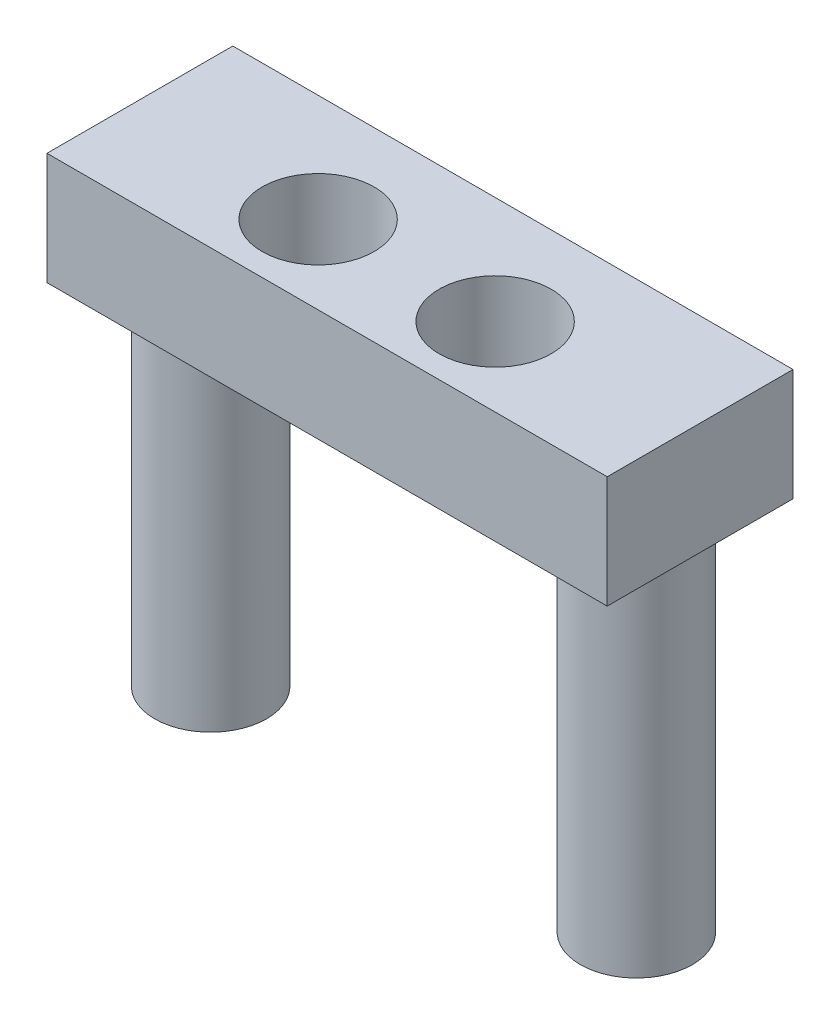
ISO-10303-21;
HEADER;
FILE_DESCRIPTION(('STEP AP214'),'2;1');
FILE_NAME('part.step','',(''),(''),'','','');
FILE_SCHEMA(('AUTOMOTIVE_DESIGN { 1 0 10303 214 1 1 1 1 }'));
ENDSEC;
DATA;
#1=APPLICATION_CONTEXT('core data for automotive mechanical design processes');
#2=APPLICATION_PROTOCOL_DEFINITION('international standard','automotive_design',2000,#1);
#3=PRODUCT_CONTEXT('',#1,'mechanical');
#4=PRODUCT('Part','Part','',(#3));
#5=PRODUCT_RELATED_PRODUCT_CATEGORY('part','',(#4));
#6=PRODUCT_DEFINITION_FORMATION('','',#4);
#7=PRODUCT_DEFINITION_CONTEXT('part definition',#1,'design');
#8=PRODUCT_DEFINITION('design','',#6,#7);
#9=PRODUCT_DEFINITION_SHAPE('','',#8);
#10=(LENGTH_UNIT() NAMED_UNIT(*) SI_UNIT(.MILLI.,.METRE.));
#11=(NAMED_UNIT(*) PLANE_ANGLE_UNIT() SI_UNIT($,.RADIAN.));
#12=(NAMED_UNIT(*) SI_UNIT($,.STERADIAN.) SOLID_ANGLE_UNIT());
#13=UNCERTAINTY_MEASURE_WITH_UNIT(LENGTH_MEASURE(1.E-05),#10,'distance_accuracy_value','');
#14=(GEOMETRIC_REPRESENTATION_CONTEXT(3) GLOBAL_UNCERTAINTY_ASSIGNED_CONTEXT((#13)) GLOBAL_UNIT_ASSIGNED_CONTEXT((#10,
#11,#12)) REPRESENTATION_CONTEXT('',''));
#15=CARTESIAN_POINT('',(0.,0.,0.));
#16=DIRECTION('',(0.,0.,1.));
#17=DIRECTION('',(1.,0.,0.));
#18=AXIS2_PLACEMENT_3D('',#15,#16,#17);
#19=CARTESIAN_POINT('',(0.,0.,0.));
#20=DIRECTION('',(0.,1.,0.));
#21=DIRECTION('',(0.,0.,1.));
#22=AXIS2_PLACEMENT_3D('',#19,#20,#21);
#23=PLANE('',#22);
#24=CARTESIAN_POINT('',(28.0616648173004,0.,-21.0042159147239));
#25=DIRECTION('',(0.,1.,0.));
#26=DIRECTION('',(0.,0.,1.));
#27=AXIS2_PLACEMENT_3D('',#24,#25,#26);
#28=CIRCLE('',#27,5.);
#29=CARTESIAN_POINT('',(28.0616648173004,0.,-16.0042159147239));
#30=VERTEX_POINT('',#29);
#31=EDGE_CURVE('E42',#30,#30,#28,.F.);
#32=ORIENTED_EDGE('',*,*,#31,.F.);
#33=EDGE_LOOP('',(#32));
#34=FACE_BOUND('',#33,.T.);
#35=CARTESIAN_POINT('',(1.26166481730041,0.,-19.4010788545759));
#36=DIRECTION('',(0.,1.,0.));
#37=DIRECTION('',(0.,0.,1.));
#38=AXIS2_PLACEMENT_3D('',#35,#36,#37);
#39=CIRCLE('',#38,5.);
#40=CARTESIAN_POINT('',(1.26166481730041,0.,-14.4010788545759));
#41=VERTEX_POINT('',#40);
#42=EDGE_CURVE('E123',#41,#41,#39,.T.);
#43=ORIENTED_EDGE('',*,*,#42,.T.);
#44=EDGE_LOOP('',(#43));
#45=FACE_BOUND('',#44,.T.);
#46=DIRECTION('',(0.,0.,1.));
#47=VECTOR('',#46,1.);
#48=CARTESIAN_POINT('',(-15.9383351826996,0.,-28.9840689625747));
#49=LINE('',#48,#47);
#50=CARTESIAN_POINT('',(-15.9383351826996,0.,-28.9840689625747));
#51=VERTEX_POINT('',#50);
#52=CARTESIAN_POINT('',(-15.9383351826996,0.,-12.4010788545759));
#53=VERTEX_POINT('',#52);
#54=EDGE_CURVE('E102',#51,#53,#49,.T.);
#55=ORIENTED_EDGE('',*,*,#54,.F.);
#56=DIRECTION('',(-1.,0.,0.));
#57=VECTOR('',#56,1.);
#58=CARTESIAN_POINT('',(-15.9383351826996,0.,-28.9840689625747));
#59=LINE('',#58,#57);
#60=CARTESIAN_POINT('',(34.0616648173004,0.,-28.9840689625747));
#61=VERTEX_POINT('',#60);
#62=EDGE_CURVE('E73',#61,#51,#59,.T.);
#63=ORIENTED_EDGE('',*,*,#62,.F.);
#64=DIRECTION('',(0.,0.,-1.));
#65=VECTOR('',#64,1.);
#66=CARTESIAN_POINT('',(34.0616648173004,0.,-28.9840689625747));
#67=LINE('',#66,#65);
#68=CARTESIAN_POINT('',(34.0616648173004,0.,-12.4010788545759));
#69=VERTEX_POINT('',#68);
#70=EDGE_CURVE('E67',#69,#61,#67,.T.);
#71=ORIENTED_EDGE('',*,*,#70,.F.);
#72=DIRECTION('',(1.,0.,0.));
#73=VECTOR('',#72,1.);
#74=CARTESIAN_POINT('',(-15.9383351826996,0.,-12.4010788545759));
#75=LINE('',#74,#73);
#76=EDGE_CURVE('E92',#53,#69,#75,.T.);
#77=ORIENTED_EDGE('',*,*,#76,.F.);
#78=EDGE_LOOP('',(#55,#63,#71,#77));
#79=FACE_BOUND('',#78,.T.);
#80=CARTESIAN_POINT('',(17.0616648173004,0.,-19.4010788545759));
#81=DIRECTION('',(0.,1.,0.));
#82=DIRECTION('',(0.,0.,1.));
#83=AXIS2_PLACEMENT_3D('',#80,#81,#82);
#84=CIRCLE('',#83,5.);
#85=CARTESIAN_POINT('',(17.0616648173004,0.,-14.4010788545759));
#86=VERTEX_POINT('',#85);
#87=EDGE_CURVE('E129',#86,#86,#84,.T.);
#88=ORIENTED_EDGE('',*,*,#87,.T.);
#89=EDGE_LOOP('',(#88));
#90=FACE_BOUND('',#89,.T.);
#91=CARTESIAN_POINT('',(-9.93833518269961,0.,-21.0042159147239));
#92=DIRECTION('',(0.,1.,0.));
#93=DIRECTION('',(0.,0.,1.));
#94=AXIS2_PLACEMENT_3D('',#91,#92,#93);
#95=CIRCLE('',#94,5.);
#96=CARTESIAN_POINT('',(-9.93833518269961,0.,-16.0042159147239));
#97=VERTEX_POINT('',#96);
#98=EDGE_CURVE('E11',#97,#97,#95,.F.);
#99=ORIENTED_EDGE('',*,*,#98,.F.);
#100=EDGE_LOOP('',(#99));
#101=FACE_BOUND('',#100,.T.);
#102=ADVANCED_FACE('F33',(#34,#45,#79,#90,#101),#23,.F.);
#103=CARTESIAN_POINT('',(0.,10.,0.));
#104=DIRECTION('',(0.,1.,0.));
#105=DIRECTION('',(0.,0.,1.));
#106=AXIS2_PLACEMENT_3D('',#103,#104,#105);
#107=PLANE('',#106);
#108=CARTESIAN_POINT('',(1.26166481730041,10.,-19.4010788545759));
#109=DIRECTION('',(0.,1.,0.));
#110=DIRECTION('',(0.,0.,1.));
#111=AXIS2_PLACEMENT_3D('',#108,#109,#110);
#112=CIRCLE('',#111,5.);
#113=CARTESIAN_POINT('',(1.26166481730041,10.,-14.4010788545759));
#114=VERTEX_POINT('',#113);
#115=EDGE_CURVE('E105',#114,#114,#112,.T.);
#116=ORIENTED_EDGE('',*,*,#115,.F.);
#117=EDGE_LOOP('',(#116));
#118=FACE_BOUND('',#117,.T.);
#119=DIRECTION('',(0.,0.,1.));
#120=VECTOR('',#119,1.);
#121=CARTESIAN_POINT('',(-15.9383351826996,10.,-28.9840689625747));
#122=LINE('',#121,#120);
#123=CARTESIAN_POINT('',(-15.9383351826996,10.,-28.9840689625747));
#124=VERTEX_POINT('',#123);
#125=CARTESIAN_POINT('',(-15.9383351826996,10.,-12.4010788545759));
#126=VERTEX_POINT('',#125);
#127=EDGE_CURVE('E87',#124,#126,#122,.T.);
#128=ORIENTED_EDGE('',*,*,#127,.T.);
#129=DIRECTION('',(1.,0.,0.));
#130=VECTOR('',#129,1.);
#131=CARTESIAN_POINT('',(-15.9383351826996,10.,-12.4010788545759));
#132=LINE('',#131,#130);
#133=CARTESIAN_POINT('',(34.0616648173004,10.,-12.4010788545759));
#134=VERTEX_POINT('',#133);
#135=EDGE_CURVE('E81',#126,#134,#132,.T.);
#136=ORIENTED_EDGE('',*,*,#135,.T.);
#137=DIRECTION('',(0.,0.,-1.));
#138=VECTOR('',#137,1.);
#139=CARTESIAN_POINT('',(34.0616648173004,10.,-28.9840689625747));
#140=LINE('',#139,#138);
#141=CARTESIAN_POINT('',(34.0616648173004,10.,-28.9840689625747));
#142=VERTEX_POINT('',#141);
#143=EDGE_CURVE('E85',#134,#142,#140,.T.);
#144=ORIENTED_EDGE('',*,*,#143,.T.);
#145=DIRECTION('',(-1.,0.,0.));
#146=VECTOR('',#145,1.);
#147=CARTESIAN_POINT('',(-15.9383351826996,10.,-28.9840689625747));
#148=LINE('',#147,#146);
#149=EDGE_CURVE('E50',#142,#124,#148,.T.);
#150=ORIENTED_EDGE('',*,*,#149,.T.);
#151=EDGE_LOOP('',(#128,#136,#144,#150));
#152=FACE_BOUND('',#151,.T.);
#153=CARTESIAN_POINT('',(17.0616648173004,10.,-19.4010788545759));
#154=DIRECTION('',(0.,1.,0.));
#155=DIRECTION('',(0.,0.,1.));
#156=AXIS2_PLACEMENT_3D('',#153,#154,#155);
#157=CIRCLE('',#156,5.);
#158=CARTESIAN_POINT('',(17.0616648173004,10.,-14.4010788545759));
#159=VERTEX_POINT('',#158);
#160=EDGE_CURVE('E152',#159,#159,#157,.T.);
#161=ORIENTED_EDGE('',*,*,#160,.F.);
#162=EDGE_LOOP('',(#161));
#163=FACE_BOUND('',#162,.T.);
#164=ADVANCED_FACE('F82',(#118,#152,#163),#107,.T.);
#165=CARTESIAN_POINT('',(-15.9383351826996,10.,-28.9840689625747));
#166=DIRECTION('',(1.,0.,0.));
#167=DIRECTION('',(0.,0.,-1.));
#168=AXIS2_PLACEMENT_3D('',#165,#166,#167);
#169=PLANE('',#168);
#170=ORIENTED_EDGE('',*,*,#54,.T.);
#171=DIRECTION('',(0.,-1.,0.));
#172=VECTOR('',#171,1.);
#173=CARTESIAN_POINT('',(-15.9383351826996,10.,-12.4010788545759));
#174=LINE('',#173,#172);
#175=EDGE_CURVE('E93',#126,#53,#174,.T.);
#176=ORIENTED_EDGE('',*,*,#175,.F.);
#177=ORIENTED_EDGE('',*,*,#127,.F.);
#178=DIRECTION('',(0.,-1.,0.));
#179=VECTOR('',#178,1.);
#180=CARTESIAN_POINT('',(-15.9383351826996,10.,-28.9840689625747));
#181=LINE('',#180,#179);
#182=EDGE_CURVE('E98',#124,#51,#181,.T.);
#183=ORIENTED_EDGE('',*,*,#182,.T.);
#184=EDGE_LOOP('',(#170,#176,#177,#183));
#185=FACE_BOUND('',#184,.T.);
#186=ADVANCED_FACE('F35',(#185),#169,.F.);
#187=CARTESIAN_POINT('',(-15.9383351826996,10.,-12.4010788545759));
#188=DIRECTION('',(0.,0.,-1.));
#189=DIRECTION('',(-1.,0.,0.));
#190=AXIS2_PLACEMENT_3D('',#187,#188,#189);
#191=PLANE('',#190);
#192=ORIENTED_EDGE('',*,*,#76,.T.);
#193=DIRECTION('',(0.,-1.,0.));
#194=VECTOR('',#193,1.);
#195=CARTESIAN_POINT('',(34.0616648173004,10.,-12.4010788545759));
#196=LINE('',#195,#194);
#197=EDGE_CURVE('E90',#134,#69,#196,.T.);
#198=ORIENTED_EDGE('',*,*,#197,.F.);
#199=ORIENTED_EDGE('',*,*,#135,.F.);
#200=ORIENTED_EDGE('',*,*,#175,.T.);
#201=EDGE_LOOP('',(#192,#198,#199,#200));
#202=FACE_BOUND('',#201,.T.);
#203=ADVANCED_FACE('F91',(#202),#191,.F.);
#204=CARTESIAN_POINT('',(34.0616648173004,10.,-28.9840689625747));
#205=DIRECTION('',(-1.,0.,0.));
#206=DIRECTION('',(0.,0.,1.));
#207=AXIS2_PLACEMENT_3D('',#204,#205,#206);
#208=PLANE('',#207);
#209=ORIENTED_EDGE('',*,*,#70,.T.);
#210=DIRECTION('',(0.,-1.,0.));
#211=VECTOR('',#210,1.);
#212=CARTESIAN_POINT('',(34.0616648173004,10.,-28.9840689625747));
#213=LINE('',#212,#211);
#214=EDGE_CURVE('E94',#142,#61,#213,.T.);
#215=ORIENTED_EDGE('',*,*,#214,.F.);
#216=ORIENTED_EDGE('',*,*,#143,.F.);
#217=ORIENTED_EDGE('',*,*,#197,.T.);
#218=EDGE_LOOP('',(#209,#215,#216,#217));
#219=FACE_BOUND('',#218,.T.);
#220=ADVANCED_FACE('F96',(#219),#208,.F.);
#221=CARTESIAN_POINT('',(-15.9383351826996,10.,-28.9840689625747));
#222=DIRECTION('',(0.,0.,1.));
#223=DIRECTION('',(1.,0.,0.));
#224=AXIS2_PLACEMENT_3D('',#221,#222,#223);
#225=PLANE('',#224);
#226=ORIENTED_EDGE('',*,*,#62,.T.);
#227=ORIENTED_EDGE('',*,*,#182,.F.);
#228=ORIENTED_EDGE('',*,*,#149,.F.);
#229=ORIENTED_EDGE('',*,*,#214,.T.);
#230=EDGE_LOOP('',(#226,#227,#228,#229));
#231=FACE_BOUND('',#230,.T.);
#232=ADVANCED_FACE('F172',(#231),#225,.F.);
#233=CARTESIAN_POINT('',(1.26166481730041,10.,-19.4010788545759));
#234=DIRECTION('',(0.,-1.,0.));
#235=DIRECTION('',(0.,0.,-1.));
#236=AXIS2_PLACEMENT_3D('',#233,#234,#235);
#237=CYLINDRICAL_SURFACE('',#236,5.);
#238=ORIENTED_EDGE('',*,*,#115,.T.);
#239=EDGE_LOOP('',(#238));
#240=FACE_BOUND('',#239,.T.);
#241=ORIENTED_EDGE('',*,*,#42,.F.);
#242=EDGE_LOOP('',(#241));
#243=FACE_BOUND('',#242,.T.);
#244=ADVANCED_FACE('F160',(#240,#243),#237,.F.);
#245=CARTESIAN_POINT('',(17.0616648173004,10.,-19.4010788545759));
#246=DIRECTION('',(0.,-1.,0.));
#247=DIRECTION('',(0.,0.,-1.));
#248=AXIS2_PLACEMENT_3D('',#245,#246,#247);
#249=CYLINDRICAL_SURFACE('',#248,5.);
#250=ORIENTED_EDGE('',*,*,#160,.T.);
#251=EDGE_LOOP('',(#250));
#252=FACE_BOUND('',#251,.T.);
#253=ORIENTED_EDGE('',*,*,#87,.F.);
#254=EDGE_LOOP('',(#253));
#255=FACE_BOUND('',#254,.T.);
#256=ADVANCED_FACE('F195',(#252,#255),#249,.F.);
#257=CARTESIAN_POINT('',(28.0616648173004,-46.657935623731,-21.0042159147239));
#258=DIRECTION('',(0.,1.,0.));
#259=DIRECTION('',(0.,0.,1.));
#260=AXIS2_PLACEMENT_3D('',#257,#258,#259);
#261=CYLINDRICAL_SURFACE('',#260,5.);
#262=ORIENTED_EDGE('',*,*,#31,.T.);
#263=EDGE_LOOP('',(#262));
#264=FACE_BOUND('',#263,.T.);
#265=CARTESIAN_POINT('',(28.0616648173004,-32.5158,-21.0042159147239));
#266=DIRECTION('',(0.,-1.,0.));
#267=DIRECTION('',(1.,0.,0.));
#268=AXIS2_PLACEMENT_3D('',#265,#266,#267);
#269=CIRCLE('',#268,5.);
#270=CARTESIAN_POINT('',(33.0616648173004,-32.5158,-21.0042159147239));
#271=VERTEX_POINT('',#270);
#272=EDGE_CURVE('E142',#271,#271,#269,.T.);
#273=ORIENTED_EDGE('',*,*,#272,.F.);
#274=EDGE_LOOP('',(#273));
#275=FACE_BOUND('',#274,.T.);
#276=ADVANCED_FACE('F114',(#264,#275),#261,.T.);
#277=CARTESIAN_POINT('',(-56.2222405999945,-32.5158,-101.325550197275));
#278=DIRECTION('',(0.,-1.,0.));
#279=DIRECTION('',(1.,0.,0.));
#280=AXIS2_PLACEMENT_3D('',#277,#278,#279);
#281=PLANE('',#280);
#282=CARTESIAN_POINT('',(28.0616648173004,-32.5158,-21.0042159147239));
#283=DIRECTION('',(0.,-1.,0.));
#284=DIRECTION('',(1.,0.,0.));
#285=AXIS2_PLACEMENT_3D('',#282,#283,#284);
#286=CIRCLE('',#285,1.75);
#287=CARTESIAN_POINT('',(29.8116648173004,-32.5158,-21.0042159147239));
#288=VERTEX_POINT('',#287);
#289=EDGE_CURVE('E148',#288,#288,#286,.T.);
#290=ORIENTED_EDGE('',*,*,#289,.F.);
#291=EDGE_LOOP('',(#290));
#292=FACE_BOUND('',#291,.T.);
#293=ORIENTED_EDGE('',*,*,#272,.T.);
#294=EDGE_LOOP('',(#293));
#295=FACE_BOUND('',#294,.T.);
#296=ADVANCED_FACE('F136',(#292,#295),#281,.T.);
#297=CARTESIAN_POINT('',(-9.93833518269961,-46.657935623731,-21.0042159147239));
#298=DIRECTION('',(0.,1.,0.));
#299=DIRECTION('',(0.,0.,1.));
#300=AXIS2_PLACEMENT_3D('',#297,#298,#299);
#301=CYLINDRICAL_SURFACE('',#300,5.);
#302=ORIENTED_EDGE('',*,*,#98,.T.);
#303=EDGE_LOOP('',(#302));
#304=FACE_BOUND('',#303,.T.);
#305=CARTESIAN_POINT('',(-9.93833518269961,-32.5158,-21.0042159147239));
#306=DIRECTION('',(0.,-1.,0.));
#307=DIRECTION('',(1.,0.,0.));
#308=AXIS2_PLACEMENT_3D('',#305,#306,#307);
#309=CIRCLE('',#308,5.);
#310=CARTESIAN_POINT('',(-4.93833518269961,-32.5158,-21.0042159147239));
#311=VERTEX_POINT('',#310);
#312=EDGE_CURVE('E140',#311,#311,#309,.T.);
#313=ORIENTED_EDGE('',*,*,#312,.F.);
#314=EDGE_LOOP('',(#313));
#315=FACE_BOUND('',#314,.T.);
#316=ADVANCED_FACE('F132',(#304,#315),#301,.T.);
#317=CARTESIAN_POINT('',(-56.2222405999945,-32.5158,-101.325550197275));
#318=DIRECTION('',(0.,-1.,0.));
#319=DIRECTION('',(1.,0.,0.));
#320=AXIS2_PLACEMENT_3D('',#317,#318,#319);
#321=PLANE('',#320);
#322=CARTESIAN_POINT('',(-9.93833518269961,-32.5158,-21.0042159147239));
#323=DIRECTION('',(0.,-1.,0.));
#324=DIRECTION('',(1.,0.,0.));
#325=AXIS2_PLACEMENT_3D('',#322,#323,#324);
#326=CIRCLE('',#325,1.75);
#327=CARTESIAN_POINT('',(-8.18833518269961,-32.5158,-21.0042159147239));
#328=VERTEX_POINT('',#327);
#329=EDGE_CURVE('E302',#328,#328,#326,.T.);
#330=ORIENTED_EDGE('',*,*,#329,.F.);
#331=EDGE_LOOP('',(#330));
#332=FACE_BOUND('',#331,.T.);
#333=ORIENTED_EDGE('',*,*,#312,.T.);
#334=EDGE_LOOP('',(#333));
#335=FACE_BOUND('',#334,.T.);
#336=ADVANCED_FACE('F135',(#332,#335),#321,.T.);
#337=CARTESIAN_POINT('',(28.0616648173004,-22.5158,-21.0042159147239));
#338=DIRECTION('',(0.,-1.,0.));
#339=DIRECTION('',(1.,0.,0.));
#340=AXIS2_PLACEMENT_3D('',#337,#338,#339);
#341=CYLINDRICAL_SURFACE('',#340,1.75);
#342=CARTESIAN_POINT('',(28.0616648173004,-22.5158,-21.0042159147239));
#343=DIRECTION('',(0.,-1.,0.));
#344=DIRECTION('',(1.,0.,0.));
#345=AXIS2_PLACEMENT_3D('',#342,#343,#344);
#346=CIRCLE('',#345,1.75);
#347=CARTESIAN_POINT('',(29.8116648173004,-22.5158,-21.0042159147239));
#348=VERTEX_POINT('',#347);
#349=EDGE_CURVE('E143',#348,#348,#346,.T.);
#350=ORIENTED_EDGE('',*,*,#349,.F.);
#351=EDGE_LOOP('',(#350));
#352=FACE_BOUND('',#351,.T.);
#353=ORIENTED_EDGE('',*,*,#289,.T.);
#354=EDGE_LOOP('',(#353));
#355=FACE_BOUND('',#354,.T.);
#356=ADVANCED_FACE('F225',(#352,#355),#341,.F.);
#357=CARTESIAN_POINT('',(28.0616648173004,-22.5158,-21.0042159147239));
#358=DIRECTION('',(0.,-1.,0.));
#359=DIRECTION('',(1.,0.,0.));
#360=AXIS2_PLACEMENT_3D('',#357,#358,#359);
#361=PLANE('',#360);
#362=ORIENTED_EDGE('',*,*,#349,.T.);
#363=EDGE_LOOP('',(#362));
#364=FACE_BOUND('',#363,.T.);
#365=ADVANCED_FACE('F233',(#364),#361,.T.);
#366=CARTESIAN_POINT('',(-9.93833518269961,-22.5158,-21.0042159147239));
#367=DIRECTION('',(0.,-1.,0.));
#368=DIRECTION('',(1.,0.,0.));
#369=AXIS2_PLACEMENT_3D('',#366,#367,#368);
#370=CYLINDRICAL_SURFACE('',#369,1.75);
#371=CARTESIAN_POINT('',(-9.93833518269961,-22.5158,-21.0042159147239));
#372=DIRECTION('',(0.,-1.,0.));
#373=DIRECTION('',(1.,0.,0.));
#374=AXIS2_PLACEMENT_3D('',#371,#372,#373);
#375=CIRCLE('',#374,1.75);
#376=CARTESIAN_POINT('',(-8.18833518269961,-22.5158,-21.0042159147239));
#377=VERTEX_POINT('',#376);
#378=EDGE_CURVE('E301',#377,#377,#375,.T.);
#379=ORIENTED_EDGE('',*,*,#378,.F.);
#380=EDGE_LOOP('',(#379));
#381=FACE_BOUND('',#380,.T.);
#382=ORIENTED_EDGE('',*,*,#329,.T.);
#383=EDGE_LOOP('',(#382));
#384=FACE_BOUND('',#383,.T.);
#385=ADVANCED_FACE('F241',(#381,#384),#370,.F.);
#386=CARTESIAN_POINT('',(-9.93833518269961,-22.5158,-21.0042159147239));
#387=DIRECTION('',(0.,-1.,0.));
#388=DIRECTION('',(1.,0.,0.));
#389=AXIS2_PLACEMENT_3D('',#386,#387,#388);
#390=PLANE('',#389);
#391=ORIENTED_EDGE('',*,*,#378,.T.);
#392=EDGE_LOOP('',(#391));
#393=FACE_BOUND('',#392,.T.);
#394=ADVANCED_FACE('F249',(#393),#390,.T.);
#395=CLOSED_SHELL('',(#102,#164,#186,#203,#220,#232,#244,#256,#276,#296,#316,#336,#356,#365,
#385,#394));
#396=MANIFOLD_SOLID_BREP('B2',#395);
#397=ADVANCED_BREP_SHAPE_REPRESENTATION('',(#18,#396),#14);
#398=SHAPE_DEFINITION_REPRESENTATION(#9,#397);
ENDSEC;
END-ISO-10303-21;
